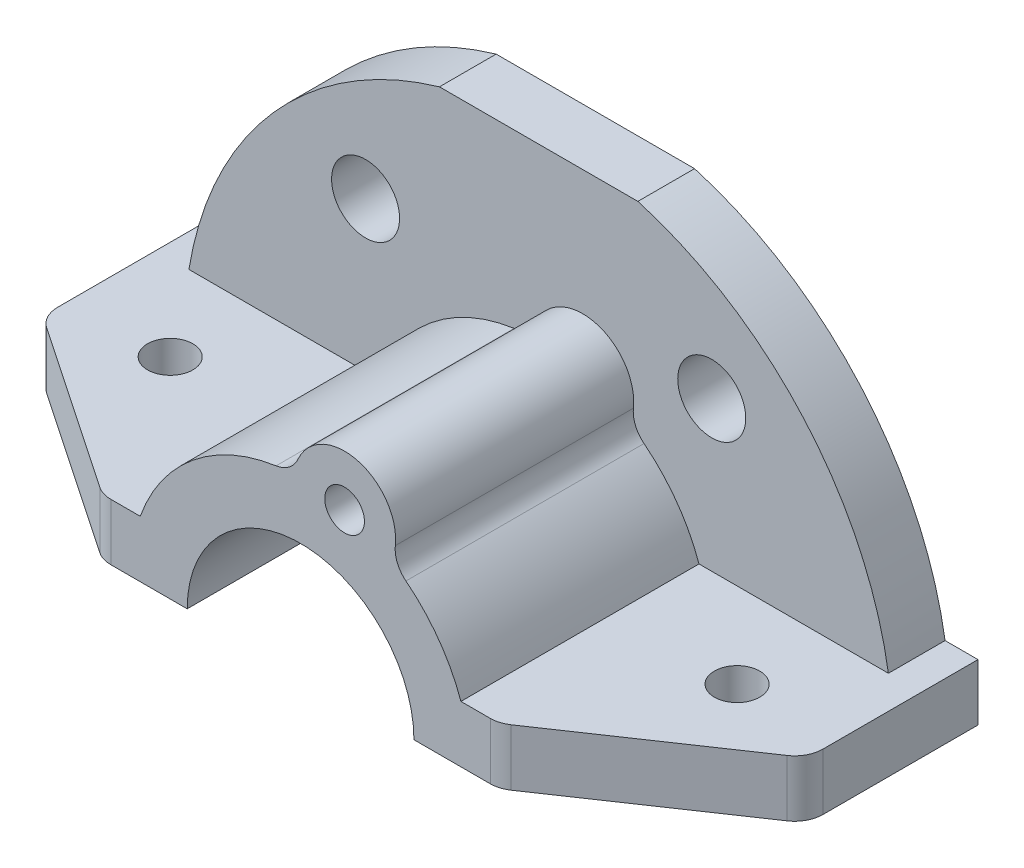
ISO-10303-21;
HEADER;
FILE_DESCRIPTION(('STEP AP214'),'2;1');
FILE_NAME('part.step','',(''),(''),'','','');
FILE_SCHEMA(('AUTOMOTIVE_DESIGN { 1 0 10303 214 1 1 1 1 }'));
ENDSEC;
DATA;
#1=APPLICATION_CONTEXT('core data for automotive mechanical design processes');
#2=APPLICATION_PROTOCOL_DEFINITION('international standard','automotive_design',2000,#1);
#3=PRODUCT_CONTEXT('',#1,'mechanical');
#4=PRODUCT('Part','Part','',(#3));
#5=PRODUCT_RELATED_PRODUCT_CATEGORY('part','',(#4));
#6=PRODUCT_DEFINITION_FORMATION('','',#4);
#7=PRODUCT_DEFINITION_CONTEXT('part definition',#1,'design');
#8=PRODUCT_DEFINITION('design','',#6,#7);
#9=PRODUCT_DEFINITION_SHAPE('','',#8);
#10=(LENGTH_UNIT() NAMED_UNIT(*) SI_UNIT(.MILLI.,.METRE.));
#11=(NAMED_UNIT(*) PLANE_ANGLE_UNIT() SI_UNIT($,.RADIAN.));
#12=(NAMED_UNIT(*) SI_UNIT($,.STERADIAN.) SOLID_ANGLE_UNIT());
#13=UNCERTAINTY_MEASURE_WITH_UNIT(LENGTH_MEASURE(1.E-05),#10,'distance_accuracy_value','');
#14=(GEOMETRIC_REPRESENTATION_CONTEXT(3) GLOBAL_UNCERTAINTY_ASSIGNED_CONTEXT((#13)) GLOBAL_UNIT_ASSIGNED_CONTEXT((#10,
#11,#12)) REPRESENTATION_CONTEXT('',''));
#15=CARTESIAN_POINT('',(0.,0.,0.));
#16=DIRECTION('',(0.,0.,1.));
#17=DIRECTION('',(1.,0.,0.));
#18=AXIS2_PLACEMENT_3D('',#15,#16,#17);
#19=CARTESIAN_POINT('',(7.76457135307574,28.977774788672,-97.0092344550981));
#20=DIRECTION('',(0.,0.,1.));
#21=DIRECTION('',(1.,0.,0.));
#22=AXIS2_PLACEMENT_3D('',#19,#20,#21);
#23=CYLINDRICAL_SURFACE('',#22,9.);
#24=CARTESIAN_POINT('',(7.76457135307574,28.977774788672,-16.));
#25=DIRECTION('',(0.,0.,-1.));
#26=DIRECTION('',(-1.,0.,0.));
#27=AXIS2_PLACEMENT_3D('',#24,#25,#26);
#28=CIRCLE('',#27,9.);
#29=CARTESIAN_POINT('',(16.7125044566661,28.0110829175612,-16.));
#30=VERTEX_POINT('',#29);
#31=CARTESIAN_POINT('',(-0.467911961552641,32.6145616224534,-16.));
#32=VERTEX_POINT('',#31);
#33=EDGE_CURVE('E256',#30,#32,#28,.F.);
#34=ORIENTED_EDGE('',*,*,#33,.T.);
#35=DIRECTION('',(0.,0.,1.));
#36=VECTOR('',#35,1.);
#37=CARTESIAN_POINT('',(-0.467911961552641,32.6145616224534,-97.0092344550981));
#38=LINE('',#37,#36);
#39=CARTESIAN_POINT('',(-0.467911961552641,32.6145616224534,26.));
#40=VERTEX_POINT('',#39);
#41=EDGE_CURVE('E400',#32,#40,#38,.T.);
#42=ORIENTED_EDGE('',*,*,#41,.T.);
#43=CARTESIAN_POINT('',(7.76457135307574,28.977774788672,26.));
#44=DIRECTION('',(0.,0.,1.));
#45=DIRECTION('',(1.,0.,0.));
#46=AXIS2_PLACEMENT_3D('',#43,#44,#45);
#47=CIRCLE('',#46,9.);
#48=CARTESIAN_POINT('',(16.7125044566661,28.0110829175612,26.));
#49=VERTEX_POINT('',#48);
#50=EDGE_CURVE('E318',#49,#40,#47,.T.);
#51=ORIENTED_EDGE('',*,*,#50,.F.);
#52=DIRECTION('',(0.,0.,1.));
#53=VECTOR('',#52,1.);
#54=CARTESIAN_POINT('',(16.7125044566661,28.0110829175612,-97.0092344550981));
#55=LINE('',#54,#53);
#56=EDGE_CURVE('E397',#49,#30,#55,.F.);
#57=ORIENTED_EDGE('',*,*,#56,.T.);
#58=EDGE_LOOP('',(#34,#42,#51,#57));
#59=FACE_BOUND('',#58,.T.);
#60=ADVANCED_FACE('F45',(#59),#23,.T.);
#61=CARTESIAN_POINT('',(0.,0.,-97.0092344550981));
#62=DIRECTION('',(0.,0.,1.));
#63=DIRECTION('',(1.,0.,0.));
#64=AXIS2_PLACEMENT_3D('',#61,#62,#63);
#65=CYLINDRICAL_SURFACE('',#64,30.);
#66=CARTESIAN_POINT('',(0.,0.,26.));
#67=DIRECTION('',(0.,0.,1.));
#68=DIRECTION('',(1.,0.,0.));
#69=AXIS2_PLACEMENT_3D('',#66,#67,#68);
#70=CIRCLE('',#69,30.);
#71=CARTESIAN_POINT('',(-4.32129754543959,29.687141787713,26.));
#72=VERTEX_POINT('',#71);
#73=CARTESIAN_POINT('',(-28.2842712474619,10.,26.));
#74=VERTEX_POINT('',#73);
#75=EDGE_CURVE('E322',#72,#74,#70,.T.);
#76=ORIENTED_EDGE('',*,*,#75,.F.);
#77=DIRECTION('',(0.,0.,1.));
#78=VECTOR('',#77,1.);
#79=CARTESIAN_POINT('',(-4.32129754543959,29.687141787713,-97.0092344550981));
#80=LINE('',#79,#78);
#81=CARTESIAN_POINT('',(-4.32129754543959,29.687141787713,-16.));
#82=VERTEX_POINT('',#81);
#83=EDGE_CURVE('E404',#72,#82,#80,.F.);
#84=ORIENTED_EDGE('',*,*,#83,.T.);
#85=CARTESIAN_POINT('',(0.,0.,-16.));
#86=DIRECTION('',(0.,0.,-1.));
#87=DIRECTION('',(-1.,0.,0.));
#88=AXIS2_PLACEMENT_3D('',#85,#86,#87);
#89=CIRCLE('',#88,30.);
#90=CARTESIAN_POINT('',(-28.2842712474619,10.,-16.));
#91=VERTEX_POINT('',#90);
#92=EDGE_CURVE('E260',#82,#91,#89,.F.);
#93=ORIENTED_EDGE('',*,*,#92,.T.);
#94=DIRECTION('',(0.,0.,1.));
#95=VECTOR('',#94,1.);
#96=CARTESIAN_POINT('',(-28.2842712474619,10.,-97.0092344550981));
#97=LINE('',#96,#95);
#98=EDGE_CURVE('E309',#91,#74,#97,.T.);
#99=ORIENTED_EDGE('',*,*,#98,.T.);
#100=EDGE_LOOP('',(#76,#84,#93,#99));
#101=FACE_BOUND('',#100,.T.);
#102=ADVANCED_FACE('F477',(#101),#65,.T.);
#103=CARTESIAN_POINT('',(0.,0.,-97.0092344550981));
#104=DIRECTION('',(0.,0.,1.));
#105=DIRECTION('',(1.,0.,0.));
#106=AXIS2_PLACEMENT_3D('',#103,#104,#105);
#107=CYLINDRICAL_SURFACE('',#106,30.);
#108=CARTESIAN_POINT('',(0.,0.,-16.));
#109=DIRECTION('',(0.,0.,-1.));
#110=DIRECTION('',(-1.,0.,0.));
#111=AXIS2_PLACEMENT_3D('',#108,#109,#110);
#112=CIRCLE('',#111,30.);
#113=CARTESIAN_POINT('',(28.2842712474619,10.,-16.));
#114=VERTEX_POINT('',#113);
#115=CARTESIAN_POINT('',(18.5859243455187,23.5491701811901,-16.));
#116=VERTEX_POINT('',#115);
#117=EDGE_CURVE('E251',#114,#116,#112,.F.);
#118=ORIENTED_EDGE('',*,*,#117,.T.);
#119=DIRECTION('',(0.,0.,1.));
#120=VECTOR('',#119,1.);
#121=CARTESIAN_POINT('',(18.5859243455187,23.5491701811901,-97.0092344550981));
#122=LINE('',#121,#120);
#123=CARTESIAN_POINT('',(18.5859243455187,23.5491701811901,26.));
#124=VERTEX_POINT('',#123);
#125=EDGE_CURVE('E413',#116,#124,#122,.T.);
#126=ORIENTED_EDGE('',*,*,#125,.T.);
#127=CARTESIAN_POINT('',(0.,0.,26.));
#128=DIRECTION('',(0.,0.,1.));
#129=DIRECTION('',(1.,0.,0.));
#130=AXIS2_PLACEMENT_3D('',#127,#128,#129);
#131=CIRCLE('',#130,30.);
#132=CARTESIAN_POINT('',(28.2842712474619,10.,26.));
#133=VERTEX_POINT('',#132);
#134=EDGE_CURVE('E314',#133,#124,#131,.T.);
#135=ORIENTED_EDGE('',*,*,#134,.F.);
#136=DIRECTION('',(0.,0.,1.));
#137=VECTOR('',#136,1.);
#138=CARTESIAN_POINT('',(28.2842712474619,10.,-97.0092344550981));
#139=LINE('',#138,#137);
#140=EDGE_CURVE('E386',#114,#133,#139,.T.);
#141=ORIENTED_EDGE('',*,*,#140,.F.);
#142=EDGE_LOOP('',(#118,#126,#135,#141));
#143=FACE_BOUND('',#142,.T.);
#144=ADVANCED_FACE('F490',(#143),#107,.T.);
#145=CARTESIAN_POINT('',(0.,10.,-26.));
#146=DIRECTION('',(0.,0.,-1.));
#147=DIRECTION('',(-1.,0.,0.));
#148=AXIS2_PLACEMENT_3D('',#145,#146,#147);
#149=PLANE('',#148);
#150=DIRECTION('',(1.,0.,0.));
#151=VECTOR('',#150,1.);
#152=CARTESIAN_POINT('',(0.,10.,-26.));
#153=LINE('',#152,#151);
#154=CARTESIAN_POINT('',(-67.5,10.,-26.));
#155=VERTEX_POINT('',#154);
#156=CARTESIAN_POINT('',(-61.6948133962653,10.,-26.));
#157=VERTEX_POINT('',#156);
#158=EDGE_CURVE('E372',#155,#157,#153,.T.);
#159=ORIENTED_EDGE('',*,*,#158,.T.);
#160=CARTESIAN_POINT('',(0.,0.,-26.));
#161=DIRECTION('',(0.,0.,-1.));
#162=DIRECTION('',(-1.,0.,0.));
#163=AXIS2_PLACEMENT_3D('',#160,#161,#162);
#164=CIRCLE('',#163,62.5);
#165=CARTESIAN_POINT('',(-17.5,60.,-26.));
#166=VERTEX_POINT('',#165);
#167=EDGE_CURVE('E237',#157,#166,#164,.T.);
#168=ORIENTED_EDGE('',*,*,#167,.T.);
#169=DIRECTION('',(1.,0.,0.));
#170=VECTOR('',#169,1.);
#171=CARTESIAN_POINT('',(0.,60.,-26.));
#172=LINE('',#171,#170);
#173=CARTESIAN_POINT('',(17.5,60.,-26.));
#174=VERTEX_POINT('',#173);
#175=EDGE_CURVE('E216',#166,#174,#172,.T.);
#176=ORIENTED_EDGE('',*,*,#175,.T.);
#177=CARTESIAN_POINT('',(61.6948133962653,10.,-26.));
#178=VERTEX_POINT('',#177);
#179=EDGE_CURVE('E240',#174,#178,#164,.T.);
#180=ORIENTED_EDGE('',*,*,#179,.T.);
#181=DIRECTION('',(1.,0.,0.));
#182=VECTOR('',#181,1.);
#183=CARTESIAN_POINT('',(0.,10.,-26.));
#184=LINE('',#183,#182);
#185=CARTESIAN_POINT('',(67.5,10.,-26.));
#186=VERTEX_POINT('',#185);
#187=EDGE_CURVE('E276',#178,#186,#184,.T.);
#188=ORIENTED_EDGE('',*,*,#187,.T.);
#189=DIRECTION('',(0.,-1.,0.));
#190=VECTOR('',#189,1.);
#191=CARTESIAN_POINT('',(67.5,10.,-26.));
#192=LINE('',#191,#190);
#193=CARTESIAN_POINT('',(67.5,0.,-26.));
#194=VERTEX_POINT('',#193);
#195=EDGE_CURVE('E287',#186,#194,#192,.T.);
#196=ORIENTED_EDGE('',*,*,#195,.T.);
#197=DIRECTION('',(1.,0.,0.));
#198=VECTOR('',#197,1.);
#199=CARTESIAN_POINT('',(0.,0.,-26.));
#200=LINE('',#199,#198);
#201=CARTESIAN_POINT('',(20.,0.,-26.));
#202=VERTEX_POINT('',#201);
#203=EDGE_CURVE('E300',#202,#194,#200,.T.);
#204=ORIENTED_EDGE('',*,*,#203,.F.);
#205=CARTESIAN_POINT('',(0.,0.,-26.));
#206=DIRECTION('',(0.,0.,1.));
#207=DIRECTION('',(1.,0.,0.));
#208=AXIS2_PLACEMENT_3D('',#205,#206,#207);
#209=CIRCLE('',#208,20.);
#210=CARTESIAN_POINT('',(-20.,0.,-26.));
#211=VERTEX_POINT('',#210);
#212=EDGE_CURVE('E335',#202,#211,#209,.T.);
#213=ORIENTED_EDGE('',*,*,#212,.T.);
#214=DIRECTION('',(1.,0.,0.));
#215=VECTOR('',#214,1.);
#216=CARTESIAN_POINT('',(0.,0.,-26.));
#217=LINE('',#216,#215);
#218=CARTESIAN_POINT('',(-67.5,0.,-26.));
#219=VERTEX_POINT('',#218);
#220=EDGE_CURVE('E341',#219,#211,#217,.T.);
#221=ORIENTED_EDGE('',*,*,#220,.F.);
#222=DIRECTION('',(0.,-1.,0.));
#223=VECTOR('',#222,1.);
#224=CARTESIAN_POINT('',(-67.5,10.,-26.));
#225=LINE('',#224,#223);
#226=EDGE_CURVE('E342',#155,#219,#225,.T.);
#227=ORIENTED_EDGE('',*,*,#226,.F.);
#228=EDGE_LOOP('',(#159,#168,#176,#180,#188,#196,#204,#213,#221,#227));
#229=FACE_BOUND('',#228,.T.);
#230=CARTESIAN_POINT('',(7.76457135307574,28.977774788672,-26.));
#231=DIRECTION('',(0.,0.,-1.));
#232=DIRECTION('',(-1.,0.,0.));
#233=AXIS2_PLACEMENT_3D('',#230,#231,#232);
#234=CIRCLE('',#233,3.5);
#235=CARTESIAN_POINT('',(4.26457135307574,28.977774788672,-26.));
#236=VERTEX_POINT('',#235);
#237=EDGE_CURVE('E305',#236,#236,#234,.F.);
#238=ORIENTED_EDGE('',*,*,#237,.T.);
#239=EDGE_LOOP('',(#238));
#240=FACE_BOUND('',#239,.T.);
#241=CARTESIAN_POINT('',(30.5324114601108,36.3871110481513,-26.));
#242=DIRECTION('',(0.,0.,-1.));
#243=DIRECTION('',(-1.,0.,0.));
#244=AXIS2_PLACEMENT_3D('',#241,#242,#243);
#245=CIRCLE('',#244,6.);
#246=CARTESIAN_POINT('',(24.5324114601108,36.3871110481513,-26.));
#247=VERTEX_POINT('',#246);
#248=EDGE_CURVE('E243',#247,#247,#245,.T.);
#249=ORIENTED_EDGE('',*,*,#248,.F.);
#250=EDGE_LOOP('',(#249));
#251=FACE_BOUND('',#250,.T.);
#252=CARTESIAN_POINT('',(-30.5324114601108,36.3871110481513,-26.));
#253=DIRECTION('',(0.,0.,-1.));
#254=DIRECTION('',(-1.,0.,0.));
#255=AXIS2_PLACEMENT_3D('',#252,#253,#254);
#256=CIRCLE('',#255,6.);
#257=CARTESIAN_POINT('',(-36.5324114601108,36.3871110481513,-26.));
#258=VERTEX_POINT('',#257);
#259=EDGE_CURVE('E209',#258,#258,#256,.F.);
#260=ORIENTED_EDGE('',*,*,#259,.T.);
#261=EDGE_LOOP('',(#260));
#262=FACE_BOUND('',#261,.T.);
#263=ADVANCED_FACE('F502',(#229,#240,#251,#262),#149,.T.);
#264=CARTESIAN_POINT('',(0.,10.,26.));
#265=DIRECTION('',(0.,0.,-1.));
#266=DIRECTION('',(-1.,0.,0.));
#267=AXIS2_PLACEMENT_3D('',#264,#265,#266);
#268=PLANE('',#267);
#269=DIRECTION('',(1.,0.,0.));
#270=VECTOR('',#269,1.);
#271=CARTESIAN_POINT('',(0.,10.,26.));
#272=LINE('',#271,#270);
#273=CARTESIAN_POINT('',(-33.4668138849135,10.,26.));
#274=VERTEX_POINT('',#273);
#275=EDGE_CURVE('E352',#274,#74,#272,.T.);
#276=ORIENTED_EDGE('',*,*,#275,.F.);
#277=DIRECTION('',(0.,-1.,0.));
#278=VECTOR('',#277,1.);
#279=CARTESIAN_POINT('',(-33.4668138849135,10.,26.));
#280=LINE('',#279,#278);
#281=CARTESIAN_POINT('',(-33.4668138849135,0.,26.));
#282=VERTEX_POINT('',#281);
#283=EDGE_CURVE('E442',#274,#282,#280,.T.);
#284=ORIENTED_EDGE('',*,*,#283,.T.);
#285=DIRECTION('',(1.,0.,0.));
#286=VECTOR('',#285,1.);
#287=CARTESIAN_POINT('',(0.,0.,26.));
#288=LINE('',#287,#286);
#289=CARTESIAN_POINT('',(-20.,0.,26.));
#290=VERTEX_POINT('',#289);
#291=EDGE_CURVE('E367',#282,#290,#288,.T.);
#292=ORIENTED_EDGE('',*,*,#291,.T.);
#293=CARTESIAN_POINT('',(0.,0.,26.));
#294=DIRECTION('',(0.,0.,1.));
#295=DIRECTION('',(1.,0.,0.));
#296=AXIS2_PLACEMENT_3D('',#293,#294,#295);
#297=CIRCLE('',#296,20.);
#298=CARTESIAN_POINT('',(20.,0.,26.));
#299=VERTEX_POINT('',#298);
#300=EDGE_CURVE('E362',#299,#290,#297,.T.);
#301=ORIENTED_EDGE('',*,*,#300,.F.);
#302=DIRECTION('',(1.,0.,0.));
#303=VECTOR('',#302,1.);
#304=CARTESIAN_POINT('',(0.,0.,26.));
#305=LINE('',#304,#303);
#306=CARTESIAN_POINT('',(33.4668138849134,0.,26.));
#307=VERTEX_POINT('',#306);
#308=EDGE_CURVE('E326',#299,#307,#305,.T.);
#309=ORIENTED_EDGE('',*,*,#308,.T.);
#310=DIRECTION('',(0.,-1.,0.));
#311=VECTOR('',#310,1.);
#312=CARTESIAN_POINT('',(33.4668138849134,10.,26.));
#313=LINE('',#312,#311);
#314=CARTESIAN_POINT('',(33.4668138849134,10.,26.));
#315=VERTEX_POINT('',#314);
#316=EDGE_CURVE('E439',#307,#315,#313,.F.);
#317=ORIENTED_EDGE('',*,*,#316,.T.);
#318=DIRECTION('',(1.,0.,0.));
#319=VECTOR('',#318,1.);
#320=CARTESIAN_POINT('',(0.,10.,26.));
#321=LINE('',#320,#319);
#322=EDGE_CURVE('E280',#133,#315,#321,.T.);
#323=ORIENTED_EDGE('',*,*,#322,.F.);
#324=ORIENTED_EDGE('',*,*,#134,.T.);
#325=CARTESIAN_POINT('',(21.6835784031052,27.4740318780551,26.));
#326=DIRECTION('',(0.,0.,-1.));
#327=DIRECTION('',(-1.,0.,0.));
#328=AXIS2_PLACEMENT_3D('',#325,#326,#327);
#329=CIRCLE('',#328,5.);
#330=EDGE_CURVE('E11',#124,#49,#329,.T.);
#331=ORIENTED_EDGE('',*,*,#330,.T.);
#332=ORIENTED_EDGE('',*,*,#50,.T.);
#333=CARTESIAN_POINT('',(-5.04151380301285,34.6349987523319,26.));
#334=DIRECTION('',(0.,0.,-1.));
#335=DIRECTION('',(-1.,0.,0.));
#336=AXIS2_PLACEMENT_3D('',#333,#334,#335);
#337=CIRCLE('',#336,5.);
#338=EDGE_CURVE('E54',#40,#72,#337,.T.);
#339=ORIENTED_EDGE('',*,*,#338,.T.);
#340=ORIENTED_EDGE('',*,*,#75,.T.);
#341=EDGE_LOOP('',(#276,#284,#292,#301,#309,#317,#323,#324,#331,#332,#339,#340));
#342=FACE_BOUND('',#341,.T.);
#343=CARTESIAN_POINT('',(7.76457135307574,28.977774788672,26.));
#344=DIRECTION('',(0.,0.,1.));
#345=DIRECTION('',(1.,0.,0.));
#346=AXIS2_PLACEMENT_3D('',#343,#344,#345);
#347=CIRCLE('',#346,3.5);
#348=CARTESIAN_POINT('',(11.2645713530757,28.977774788672,26.));
#349=VERTEX_POINT('',#348);
#350=EDGE_CURVE('E304',#349,#349,#347,.T.);
#351=ORIENTED_EDGE('',*,*,#350,.F.);
#352=EDGE_LOOP('',(#351));
#353=FACE_BOUND('',#352,.T.);
#354=ADVANCED_FACE('F470',(#342,#353),#268,.F.);
#355=CARTESIAN_POINT('',(0.,10.,0.));
#356=DIRECTION('',(0.,1.,0.));
#357=DIRECTION('',(0.,0.,1.));
#358=AXIS2_PLACEMENT_3D('',#355,#356,#357);
#359=PLANE('',#358);
#360=DIRECTION('',(0.,0.,-1.));
#361=VECTOR('',#360,1.);
#362=CARTESIAN_POINT('',(-67.5,10.,0.));
#363=LINE('',#362,#361);
#364=CARTESIAN_POINT('',(-67.5,10.,1.34676632209526));
#365=VERTEX_POINT('',#364);
#366=EDGE_CURVE('E347',#365,#155,#363,.T.);
#367=ORIENTED_EDGE('',*,*,#366,.F.);
#368=CARTESIAN_POINT('',(-62.5,10.,1.34676632209526));
#369=DIRECTION('',(0.,1.,0.));
#370=DIRECTION('',(0.,0.,1.));
#371=AXIS2_PLACEMENT_3D('',#368,#369,#370);
#372=CIRCLE('',#371,5.);
#373=CARTESIAN_POINT('',(-65.302832059537,10.,5.48731368277494));
#374=VERTEX_POINT('',#373);
#375=EDGE_CURVE('E436',#365,#374,#372,.T.);
#376=ORIENTED_EDGE('',*,*,#375,.T.);
#377=DIRECTION('',(0.828109472135937,0.,0.560566411907403));
#378=VECTOR('',#377,1.);
#379=CARTESIAN_POINT('',(-23.0676838175621,10.,34.0772601850349));
#380=LINE('',#379,#378);
#381=CARTESIAN_POINT('',(-36.2696459444505,10.,25.1405473606797));
#382=VERTEX_POINT('',#381);
#383=EDGE_CURVE('E363',#374,#382,#380,.T.);
#384=ORIENTED_EDGE('',*,*,#383,.T.);
#385=CARTESIAN_POINT('',(-33.4668138849135,10.,21.));
#386=DIRECTION('',(0.,1.,0.));
#387=DIRECTION('',(0.,0.,1.));
#388=AXIS2_PLACEMENT_3D('',#385,#386,#387);
#389=CIRCLE('',#388,5.);
#390=EDGE_CURVE('E433',#382,#274,#389,.T.);
#391=ORIENTED_EDGE('',*,*,#390,.T.);
#392=ORIENTED_EDGE('',*,*,#275,.T.);
#393=ORIENTED_EDGE('',*,*,#98,.F.);
#394=DIRECTION('',(-1.,0.,0.));
#395=VECTOR('',#394,1.);
#396=CARTESIAN_POINT('',(0.,10.,-16.));
#397=LINE('',#396,#395);
#398=CARTESIAN_POINT('',(-61.6948133962653,10.,-16.));
#399=VERTEX_POINT('',#398);
#400=EDGE_CURVE('E263',#91,#399,#397,.T.);
#401=ORIENTED_EDGE('',*,*,#400,.T.);
#402=DIRECTION('',(0.,0.,-1.));
#403=VECTOR('',#402,1.);
#404=CARTESIAN_POINT('',(-61.6948133962653,10.,-16.));
#405=LINE('',#404,#403);
#406=EDGE_CURVE('E202',#157,#399,#405,.F.);
#407=ORIENTED_EDGE('',*,*,#406,.F.);
#408=ORIENTED_EDGE('',*,*,#158,.F.);
#409=EDGE_LOOP('',(#367,#376,#384,#391,#392,#393,#401,#407,#408));
#410=FACE_BOUND('',#409,.T.);
#411=CARTESIAN_POINT('',(-50.,10.,-0.999999999999997));
#412=DIRECTION('',(0.,1.,0.));
#413=DIRECTION('',(0.,0.,1.));
#414=AXIS2_PLACEMENT_3D('',#411,#412,#413);
#415=CIRCLE('',#414,4.00000000000001);
#416=CARTESIAN_POINT('',(-50.,10.,3.00000000000001));
#417=VERTEX_POINT('',#416);
#418=EDGE_CURVE('E356',#417,#417,#415,.T.);
#419=ORIENTED_EDGE('',*,*,#418,.F.);
#420=EDGE_LOOP('',(#419));
#421=FACE_BOUND('',#420,.T.);
#422=ADVANCED_FACE('F508',(#410,#421),#359,.T.);
#423=CARTESIAN_POINT('',(0.,0.,0.));
#424=DIRECTION('',(0.,1.,0.));
#425=DIRECTION('',(0.,0.,1.));
#426=AXIS2_PLACEMENT_3D('',#423,#424,#425);
#427=PLANE('',#426);
#428=CARTESIAN_POINT('',(-50.,0.,-0.999999999999997));
#429=DIRECTION('',(0.,1.,0.));
#430=DIRECTION('',(0.,0.,1.));
#431=AXIS2_PLACEMENT_3D('',#428,#429,#430);
#432=CIRCLE('',#431,4.00000000000001);
#433=CARTESIAN_POINT('',(-50.,0.,3.00000000000001));
#434=VERTEX_POINT('',#433);
#435=EDGE_CURVE('E348',#434,#434,#432,.T.);
#436=ORIENTED_EDGE('',*,*,#435,.T.);
#437=EDGE_LOOP('',(#436));
#438=FACE_BOUND('',#437,.T.);
#439=DIRECTION('',(0.828109472135937,0.,0.560566411907403));
#440=VECTOR('',#439,1.);
#441=CARTESIAN_POINT('',(-23.0676838175621,0.,34.0772601850349));
#442=LINE('',#441,#440);
#443=CARTESIAN_POINT('',(-65.302832059537,0.,5.48731368277494));
#444=VERTEX_POINT('',#443);
#445=CARTESIAN_POINT('',(-36.2696459444505,0.,25.1405473606797));
#446=VERTEX_POINT('',#445);
#447=EDGE_CURVE('E346',#444,#446,#442,.T.);
#448=ORIENTED_EDGE('',*,*,#447,.F.);
#449=CARTESIAN_POINT('',(-62.5,0.,1.34676632209526));
#450=DIRECTION('',(0.,1.,0.));
#451=DIRECTION('',(0.,0.,1.));
#452=AXIS2_PLACEMENT_3D('',#449,#450,#451);
#453=CIRCLE('',#452,5.);
#454=CARTESIAN_POINT('',(-67.5,0.,1.34676632209526));
#455=VERTEX_POINT('',#454);
#456=EDGE_CURVE('E427',#444,#455,#453,.F.);
#457=ORIENTED_EDGE('',*,*,#456,.T.);
#458=DIRECTION('',(0.,0.,-1.));
#459=VECTOR('',#458,1.);
#460=CARTESIAN_POINT('',(-67.5,0.,0.));
#461=LINE('',#460,#459);
#462=EDGE_CURVE('E340',#455,#219,#461,.T.);
#463=ORIENTED_EDGE('',*,*,#462,.T.);
#464=ORIENTED_EDGE('',*,*,#220,.T.);
#465=DIRECTION('',(0.,0.,1.));
#466=VECTOR('',#465,1.);
#467=CARTESIAN_POINT('',(-20.,0.,-26.));
#468=LINE('',#467,#466);
#469=EDGE_CURVE('E336',#211,#290,#468,.T.);
#470=ORIENTED_EDGE('',*,*,#469,.T.);
#471=ORIENTED_EDGE('',*,*,#291,.F.);
#472=CARTESIAN_POINT('',(-33.4668138849135,0.,21.));
#473=DIRECTION('',(0.,1.,0.));
#474=DIRECTION('',(0.,0.,1.));
#475=AXIS2_PLACEMENT_3D('',#472,#473,#474);
#476=CIRCLE('',#475,5.);
#477=EDGE_CURVE('E424',#282,#446,#476,.F.);
#478=ORIENTED_EDGE('',*,*,#477,.T.);
#479=EDGE_LOOP('',(#448,#457,#463,#464,#470,#471,#478));
#480=FACE_BOUND('',#479,.T.);
#481=ADVANCED_FACE('F518',(#438,#480),#427,.F.);
#482=CARTESIAN_POINT('',(-67.5,10.,0.));
#483=DIRECTION('',(-1.,0.,0.));
#484=DIRECTION('',(0.,0.,1.));
#485=AXIS2_PLACEMENT_3D('',#482,#483,#484);
#486=PLANE('',#485);
#487=ORIENTED_EDGE('',*,*,#462,.F.);
#488=DIRECTION('',(0.,-1.,0.));
#489=VECTOR('',#488,1.);
#490=CARTESIAN_POINT('',(-67.5,10.,1.34676632209526));
#491=LINE('',#490,#489);
#492=EDGE_CURVE('E430',#455,#365,#491,.F.);
#493=ORIENTED_EDGE('',*,*,#492,.T.);
#494=ORIENTED_EDGE('',*,*,#366,.T.);
#495=ORIENTED_EDGE('',*,*,#226,.T.);
#496=EDGE_LOOP('',(#487,#493,#494,#495));
#497=FACE_BOUND('',#496,.T.);
#498=ADVANCED_FACE('F529',(#497),#486,.T.);
#499=CARTESIAN_POINT('',(-23.0676838175621,10.,34.0772601850349));
#500=DIRECTION('',(0.560566411907403,0.,-0.828109472135937));
#501=DIRECTION('',(-0.828109472135937,0.,-0.560566411907403));
#502=AXIS2_PLACEMENT_3D('',#499,#500,#501);
#503=PLANE('',#502);
#504=ORIENTED_EDGE('',*,*,#383,.F.);
#505=DIRECTION('',(0.,-1.,0.));
#506=VECTOR('',#505,1.);
#507=CARTESIAN_POINT('',(-65.302832059537,0.,5.48731368277494));
#508=LINE('',#507,#506);
#509=EDGE_CURVE('E420',#374,#444,#508,.T.);
#510=ORIENTED_EDGE('',*,*,#509,.T.);
#511=ORIENTED_EDGE('',*,*,#447,.T.);
#512=DIRECTION('',(0.,-1.,0.));
#513=VECTOR('',#512,1.);
#514=CARTESIAN_POINT('',(-36.2696459444505,10.,25.1405473606797));
#515=LINE('',#514,#513);
#516=EDGE_CURVE('E417',#446,#382,#515,.F.);
#517=ORIENTED_EDGE('',*,*,#516,.T.);
#518=EDGE_LOOP('',(#504,#510,#511,#517));
#519=FACE_BOUND('',#518,.T.);
#520=ADVANCED_FACE('F521',(#519),#503,.F.);
#521=CARTESIAN_POINT('',(-50.,10.,-0.999999999999997));
#522=DIRECTION('',(0.,-1.,0.));
#523=DIRECTION('',(0.,0.,-1.));
#524=AXIS2_PLACEMENT_3D('',#521,#522,#523);
#525=CYLINDRICAL_SURFACE('',#524,4.00000000000001);
#526=ORIENTED_EDGE('',*,*,#418,.T.);
#527=EDGE_LOOP('',(#526));
#528=FACE_BOUND('',#527,.T.);
#529=ORIENTED_EDGE('',*,*,#435,.F.);
#530=EDGE_LOOP('',(#529));
#531=FACE_BOUND('',#530,.T.);
#532=ADVANCED_FACE('F582',(#528,#531),#525,.F.);
#533=CARTESIAN_POINT('',(0.,0.,-26.));
#534=DIRECTION('',(0.,0.,1.));
#535=DIRECTION('',(1.,0.,0.));
#536=AXIS2_PLACEMENT_3D('',#533,#534,#535);
#537=CYLINDRICAL_SURFACE('',#536,20.);
#538=DIRECTION('',(0.,0.,1.));
#539=VECTOR('',#538,1.);
#540=CARTESIAN_POINT('',(20.,0.,-97.0092344550981));
#541=LINE('',#540,#539);
#542=EDGE_CURVE('E310',#202,#299,#541,.T.);
#543=ORIENTED_EDGE('',*,*,#542,.T.);
#544=ORIENTED_EDGE('',*,*,#300,.T.);
#545=ORIENTED_EDGE('',*,*,#469,.F.);
#546=ORIENTED_EDGE('',*,*,#212,.F.);
#547=EDGE_LOOP('',(#543,#544,#545,#546));
#548=FACE_BOUND('',#547,.T.);
#549=ADVANCED_FACE('F535',(#548),#537,.F.);
#550=CARTESIAN_POINT('',(7.76457135307574,28.977774788672,-97.0092344550981));
#551=DIRECTION('',(0.,0.,1.));
#552=DIRECTION('',(1.,0.,0.));
#553=AXIS2_PLACEMENT_3D('',#550,#551,#552);
#554=CYLINDRICAL_SURFACE('',#553,3.5);
#555=ORIENTED_EDGE('',*,*,#237,.F.);
#556=EDGE_LOOP('',(#555));
#557=FACE_BOUND('',#556,.T.);
#558=ORIENTED_EDGE('',*,*,#350,.T.);
#559=EDGE_LOOP('',(#558));
#560=FACE_BOUND('',#559,.T.);
#561=ADVANCED_FACE('F574',(#557,#560),#554,.F.);
#562=CARTESIAN_POINT('',(0.,0.,-97.0092344550981));
#563=DIRECTION('',(0.,-1.,0.));
#564=DIRECTION('',(0.,0.,-1.));
#565=AXIS2_PLACEMENT_3D('',#562,#563,#564);
#566=PLANE('',#565);
#567=DIRECTION('',(0.,0.,-1.));
#568=VECTOR('',#567,1.);
#569=CARTESIAN_POINT('',(67.5,0.,0.));
#570=LINE('',#569,#568);
#571=CARTESIAN_POINT('',(67.5,0.,1.34676632209523));
#572=VERTEX_POINT('',#571);
#573=EDGE_CURVE('E291',#572,#194,#570,.T.);
#574=ORIENTED_EDGE('',*,*,#573,.F.);
#575=CARTESIAN_POINT('',(62.5,0.,1.34676632209523));
#576=DIRECTION('',(0.,-1.,0.));
#577=DIRECTION('',(0.,0.,-1.));
#578=AXIS2_PLACEMENT_3D('',#575,#576,#577);
#579=CIRCLE('',#578,5.);
#580=CARTESIAN_POINT('',(65.302832059537,0.,5.48731368277491));
#581=VERTEX_POINT('',#580);
#582=EDGE_CURVE('E453',#572,#581,#579,.T.);
#583=ORIENTED_EDGE('',*,*,#582,.T.);
#584=DIRECTION('',(-0.828109472135936,0.,0.560566411907404));
#585=VECTOR('',#584,1.);
#586=CARTESIAN_POINT('',(23.0676838175621,0.,34.0772601850349));
#587=LINE('',#586,#585);
#588=CARTESIAN_POINT('',(36.2696459444505,0.,25.1405473606797));
#589=VERTEX_POINT('',#588);
#590=EDGE_CURVE('E268',#581,#589,#587,.T.);
#591=ORIENTED_EDGE('',*,*,#590,.T.);
#592=CARTESIAN_POINT('',(33.4668138849134,0.,21.));
#593=DIRECTION('',(0.,-1.,0.));
#594=DIRECTION('',(0.,0.,-1.));
#595=AXIS2_PLACEMENT_3D('',#592,#593,#594);
#596=CIRCLE('',#595,5.);
#597=EDGE_CURVE('E450',#589,#307,#596,.T.);
#598=ORIENTED_EDGE('',*,*,#597,.T.);
#599=ORIENTED_EDGE('',*,*,#308,.F.);
#600=ORIENTED_EDGE('',*,*,#542,.F.);
#601=ORIENTED_EDGE('',*,*,#203,.T.);
#602=EDGE_LOOP('',(#574,#583,#591,#598,#599,#600,#601));
#603=FACE_BOUND('',#602,.T.);
#604=CARTESIAN_POINT('',(50.,0.,-1.00000000000001));
#605=DIRECTION('',(0.,1.,0.));
#606=DIRECTION('',(0.,0.,1.));
#607=AXIS2_PLACEMENT_3D('',#604,#605,#606);
#608=CIRCLE('',#607,4.00000000000001);
#609=CARTESIAN_POINT('',(50.,0.,3.));
#610=VERTEX_POINT('',#609);
#611=EDGE_CURVE('E273',#610,#610,#608,.F.);
#612=ORIENTED_EDGE('',*,*,#611,.F.);
#613=EDGE_LOOP('',(#612));
#614=FACE_BOUND('',#613,.T.);
#615=ADVANCED_FACE('F541',(#603,#614),#566,.T.);
#616=CARTESIAN_POINT('',(50.,10.,-1.00000000000001));
#617=DIRECTION('',(0.,-1.,0.));
#618=DIRECTION('',(0.,0.,-1.));
#619=AXIS2_PLACEMENT_3D('',#616,#617,#618);
#620=CYLINDRICAL_SURFACE('',#619,4.00000000000001);
#621=CARTESIAN_POINT('',(50.,10.,-1.00000000000001));
#622=DIRECTION('',(0.,1.,0.));
#623=DIRECTION('',(0.,0.,1.));
#624=AXIS2_PLACEMENT_3D('',#621,#622,#623);
#625=CIRCLE('',#624,4.00000000000001);
#626=CARTESIAN_POINT('',(50.,10.,3.));
#627=VERTEX_POINT('',#626);
#628=EDGE_CURVE('E283',#627,#627,#625,.F.);
#629=ORIENTED_EDGE('',*,*,#628,.F.);
#630=EDGE_LOOP('',(#629));
#631=FACE_BOUND('',#630,.T.);
#632=ORIENTED_EDGE('',*,*,#611,.T.);
#633=EDGE_LOOP('',(#632));
#634=FACE_BOUND('',#633,.T.);
#635=ADVANCED_FACE('F561',(#631,#634),#620,.F.);
#636=CARTESIAN_POINT('',(23.0676838175621,10.,34.0772601850349));
#637=DIRECTION('',(0.560566411907404,0.,0.828109472135936));
#638=DIRECTION('',(0.828109472135937,0.,-0.560566411907404));
#639=AXIS2_PLACEMENT_3D('',#636,#637,#638);
#640=PLANE('',#639);
#641=ORIENTED_EDGE('',*,*,#590,.F.);
#642=DIRECTION('',(0.,-1.,0.));
#643=VECTOR('',#642,1.);
#644=CARTESIAN_POINT('',(65.302832059537,10.,5.48731368277492));
#645=LINE('',#644,#643);
#646=CARTESIAN_POINT('',(65.302832059537,10.,5.48731368277491));
#647=VERTEX_POINT('',#646);
#648=EDGE_CURVE('E68',#581,#647,#645,.F.);
#649=ORIENTED_EDGE('',*,*,#648,.T.);
#650=DIRECTION('',(-0.828109472135936,0.,0.560566411907404));
#651=VECTOR('',#650,1.);
#652=CARTESIAN_POINT('',(23.0676838175621,10.,34.0772601850349));
#653=LINE('',#652,#651);
#654=CARTESIAN_POINT('',(36.2696459444505,10.,25.1405473606797));
#655=VERTEX_POINT('',#654);
#656=EDGE_CURVE('E269',#647,#655,#653,.T.);
#657=ORIENTED_EDGE('',*,*,#656,.T.);
#658=DIRECTION('',(0.,-1.,0.));
#659=VECTOR('',#658,1.);
#660=CARTESIAN_POINT('',(36.2696459444505,0.,25.1405473606797));
#661=LINE('',#660,#659);
#662=EDGE_CURVE('E456',#655,#589,#661,.T.);
#663=ORIENTED_EDGE('',*,*,#662,.T.);
#664=EDGE_LOOP('',(#641,#649,#657,#663));
#665=FACE_BOUND('',#664,.T.);
#666=ADVANCED_FACE('F545',(#665),#640,.T.);
#667=CARTESIAN_POINT('',(67.5,10.,0.));
#668=DIRECTION('',(-1.,0.,0.));
#669=DIRECTION('',(0.,0.,1.));
#670=AXIS2_PLACEMENT_3D('',#667,#668,#669);
#671=PLANE('',#670);
#672=DIRECTION('',(0.,0.,-1.));
#673=VECTOR('',#672,1.);
#674=CARTESIAN_POINT('',(67.5,10.,0.));
#675=LINE('',#674,#673);
#676=CARTESIAN_POINT('',(67.5,10.,1.34676632209523));
#677=VERTEX_POINT('',#676);
#678=EDGE_CURVE('E272',#677,#186,#675,.T.);
#679=ORIENTED_EDGE('',*,*,#678,.F.);
#680=DIRECTION('',(0.,-1.,0.));
#681=VECTOR('',#680,1.);
#682=CARTESIAN_POINT('',(67.5,0.,1.34676632209523));
#683=LINE('',#682,#681);
#684=EDGE_CURVE('E446',#677,#572,#683,.T.);
#685=ORIENTED_EDGE('',*,*,#684,.T.);
#686=ORIENTED_EDGE('',*,*,#573,.T.);
#687=ORIENTED_EDGE('',*,*,#195,.F.);
#688=EDGE_LOOP('',(#679,#685,#686,#687));
#689=FACE_BOUND('',#688,.T.);
#690=ADVANCED_FACE('F552',(#689),#671,.F.);
#691=CARTESIAN_POINT('',(0.,10.,0.));
#692=DIRECTION('',(0.,1.,0.));
#693=DIRECTION('',(0.,0.,1.));
#694=AXIS2_PLACEMENT_3D('',#691,#692,#693);
#695=PLANE('',#694);
#696=ORIENTED_EDGE('',*,*,#656,.F.);
#697=CARTESIAN_POINT('',(62.5,10.,1.34676632209523));
#698=DIRECTION('',(0.,1.,0.));
#699=DIRECTION('',(0.,0.,1.));
#700=AXIS2_PLACEMENT_3D('',#697,#698,#699);
#701=CIRCLE('',#700,5.);
#702=EDGE_CURVE('E464',#647,#677,#701,.T.);
#703=ORIENTED_EDGE('',*,*,#702,.T.);
#704=ORIENTED_EDGE('',*,*,#678,.T.);
#705=ORIENTED_EDGE('',*,*,#187,.F.);
#706=DIRECTION('',(0.,0.,-1.));
#707=VECTOR('',#706,1.);
#708=CARTESIAN_POINT('',(61.6948133962653,10.,-16.));
#709=LINE('',#708,#707);
#710=CARTESIAN_POINT('',(61.6948133962653,10.,-16.));
#711=VERTEX_POINT('',#710);
#712=EDGE_CURVE('E393',#711,#178,#709,.T.);
#713=ORIENTED_EDGE('',*,*,#712,.F.);
#714=DIRECTION('',(-1.,0.,0.));
#715=VECTOR('',#714,1.);
#716=CARTESIAN_POINT('',(0.,10.,-16.));
#717=LINE('',#716,#715);
#718=EDGE_CURVE('E389',#711,#114,#717,.T.);
#719=ORIENTED_EDGE('',*,*,#718,.T.);
#720=ORIENTED_EDGE('',*,*,#140,.T.);
#721=ORIENTED_EDGE('',*,*,#322,.T.);
#722=CARTESIAN_POINT('',(33.4668138849134,10.,21.));
#723=DIRECTION('',(0.,1.,0.));
#724=DIRECTION('',(0.,0.,1.));
#725=AXIS2_PLACEMENT_3D('',#722,#723,#724);
#726=CIRCLE('',#725,5.);
#727=EDGE_CURVE('E61',#315,#655,#726,.T.);
#728=ORIENTED_EDGE('',*,*,#727,.T.);
#729=EDGE_LOOP('',(#696,#703,#704,#705,#713,#719,#720,#721,#728));
#730=FACE_BOUND('',#729,.T.);
#731=ORIENTED_EDGE('',*,*,#628,.T.);
#732=EDGE_LOOP('',(#731));
#733=FACE_BOUND('',#732,.T.);
#734=ADVANCED_FACE('F493',(#730,#733),#695,.T.);
#735=CARTESIAN_POINT('',(0.,0.,-16.));
#736=DIRECTION('',(0.,0.,-1.));
#737=DIRECTION('',(-1.,0.,0.));
#738=AXIS2_PLACEMENT_3D('',#735,#736,#737);
#739=CYLINDRICAL_SURFACE('',#738,62.5);
#740=CARTESIAN_POINT('',(0.,0.,-16.));
#741=DIRECTION('',(0.,0.,-1.));
#742=DIRECTION('',(-1.,0.,0.));
#743=AXIS2_PLACEMENT_3D('',#740,#741,#742);
#744=CIRCLE('',#743,62.5);
#745=CARTESIAN_POINT('',(17.5,60.,-16.));
#746=VERTEX_POINT('',#745);
#747=EDGE_CURVE('E211',#746,#711,#744,.T.);
#748=ORIENTED_EDGE('',*,*,#747,.T.);
#749=ORIENTED_EDGE('',*,*,#712,.T.);
#750=ORIENTED_EDGE('',*,*,#179,.F.);
#751=DIRECTION('',(0.,0.,-1.));
#752=VECTOR('',#751,1.);
#753=CARTESIAN_POINT('',(17.5,60.,-16.));
#754=LINE('',#753,#752);
#755=EDGE_CURVE('E218',#746,#174,#754,.T.);
#756=ORIENTED_EDGE('',*,*,#755,.F.);
#757=EDGE_LOOP('',(#748,#749,#750,#756));
#758=FACE_BOUND('',#757,.T.);
#759=ADVANCED_FACE('F498',(#758),#739,.T.);
#760=CARTESIAN_POINT('',(0.,60.,-16.));
#761=DIRECTION('',(0.,1.,0.));
#762=DIRECTION('',(0.,0.,1.));
#763=AXIS2_PLACEMENT_3D('',#760,#761,#762);
#764=PLANE('',#763);
#765=ORIENTED_EDGE('',*,*,#175,.F.);
#766=DIRECTION('',(0.,0.,-1.));
#767=VECTOR('',#766,1.);
#768=CARTESIAN_POINT('',(-17.5,60.,-16.));
#769=LINE('',#768,#767);
#770=CARTESIAN_POINT('',(-17.5,60.,-16.));
#771=VERTEX_POINT('',#770);
#772=EDGE_CURVE('E199',#771,#166,#769,.T.);
#773=ORIENTED_EDGE('',*,*,#772,.F.);
#774=DIRECTION('',(1.,0.,0.));
#775=VECTOR('',#774,1.);
#776=CARTESIAN_POINT('',(0.,60.,-16.));
#777=LINE('',#776,#775);
#778=EDGE_CURVE('E208',#771,#746,#777,.T.);
#779=ORIENTED_EDGE('',*,*,#778,.T.);
#780=ORIENTED_EDGE('',*,*,#755,.T.);
#781=EDGE_LOOP('',(#765,#773,#779,#780));
#782=FACE_BOUND('',#781,.T.);
#783=ADVANCED_FACE('F214',(#782),#764,.T.);
#784=CARTESIAN_POINT('',(30.5324114601108,36.3871110481513,-16.));
#785=DIRECTION('',(0.,0.,-1.));
#786=DIRECTION('',(-1.,0.,0.));
#787=AXIS2_PLACEMENT_3D('',#784,#785,#786);
#788=CYLINDRICAL_SURFACE('',#787,6.);
#789=CARTESIAN_POINT('',(30.5324114601108,36.3871110481513,-16.));
#790=DIRECTION('',(0.,0.,-1.));
#791=DIRECTION('',(-1.,0.,0.));
#792=AXIS2_PLACEMENT_3D('',#789,#790,#791);
#793=CIRCLE('',#792,6.);
#794=CARTESIAN_POINT('',(24.5324114601108,36.3871110481513,-16.));
#795=VERTEX_POINT('',#794);
#796=EDGE_CURVE('E229',#795,#795,#793,.T.);
#797=ORIENTED_EDGE('',*,*,#796,.F.);
#798=EDGE_LOOP('',(#797));
#799=FACE_BOUND('',#798,.T.);
#800=ORIENTED_EDGE('',*,*,#248,.T.);
#801=EDGE_LOOP('',(#800));
#802=FACE_BOUND('',#801,.T.);
#803=ADVANCED_FACE('F756',(#799,#802),#788,.F.);
#804=ORIENTED_EDGE('',*,*,#167,.F.);
#805=ORIENTED_EDGE('',*,*,#406,.T.);
#806=EDGE_CURVE('E196',#399,#771,#744,.T.);
#807=ORIENTED_EDGE('',*,*,#806,.T.);
#808=ORIENTED_EDGE('',*,*,#772,.T.);
#809=EDGE_LOOP('',(#804,#805,#807,#808));
#810=FACE_BOUND('',#809,.T.);
#811=ADVANCED_FACE('F198',(#810),#739,.T.);
#812=CARTESIAN_POINT('',(-30.5324114601108,36.3871110481513,-16.));
#813=DIRECTION('',(0.,0.,-1.));
#814=DIRECTION('',(-1.,0.,0.));
#815=AXIS2_PLACEMENT_3D('',#812,#813,#814);
#816=CYLINDRICAL_SURFACE('',#815,6.);
#817=CARTESIAN_POINT('',(-30.5324114601108,36.3871110481513,-16.));
#818=DIRECTION('',(0.,0.,-1.));
#819=DIRECTION('',(-1.,0.,0.));
#820=AXIS2_PLACEMENT_3D('',#817,#818,#819);
#821=CIRCLE('',#820,6.);
#822=CARTESIAN_POINT('',(-36.5324114601108,36.3871110481513,-16.));
#823=VERTEX_POINT('',#822);
#824=EDGE_CURVE('E219',#823,#823,#821,.F.);
#825=ORIENTED_EDGE('',*,*,#824,.T.);
#826=EDGE_LOOP('',(#825));
#827=FACE_BOUND('',#826,.T.);
#828=ORIENTED_EDGE('',*,*,#259,.F.);
#829=EDGE_LOOP('',(#828));
#830=FACE_BOUND('',#829,.T.);
#831=ADVANCED_FACE('F653',(#827,#830),#816,.F.);
#832=CARTESIAN_POINT('',(0.,0.,-16.));
#833=DIRECTION('',(0.,0.,-1.));
#834=DIRECTION('',(-1.,0.,0.));
#835=AXIS2_PLACEMENT_3D('',#832,#833,#834);
#836=PLANE('',#835);
#837=ORIENTED_EDGE('',*,*,#92,.F.);
#838=CARTESIAN_POINT('',(-5.04151380301285,34.6349987523319,-16.));
#839=DIRECTION('',(0.,0.,-1.));
#840=DIRECTION('',(-1.,0.,0.));
#841=AXIS2_PLACEMENT_3D('',#838,#839,#840);
#842=CIRCLE('',#841,5.);
#843=EDGE_CURVE('E410',#82,#32,#842,.F.);
#844=ORIENTED_EDGE('',*,*,#843,.T.);
#845=ORIENTED_EDGE('',*,*,#33,.F.);
#846=CARTESIAN_POINT('',(21.6835784031052,27.4740318780551,-16.));
#847=DIRECTION('',(0.,0.,-1.));
#848=DIRECTION('',(-1.,0.,0.));
#849=AXIS2_PLACEMENT_3D('',#846,#847,#848);
#850=CIRCLE('',#849,5.);
#851=EDGE_CURVE('E407',#30,#116,#850,.F.);
#852=ORIENTED_EDGE('',*,*,#851,.T.);
#853=ORIENTED_EDGE('',*,*,#117,.F.);
#854=ORIENTED_EDGE('',*,*,#718,.F.);
#855=ORIENTED_EDGE('',*,*,#747,.F.);
#856=ORIENTED_EDGE('',*,*,#778,.F.);
#857=ORIENTED_EDGE('',*,*,#806,.F.);
#858=ORIENTED_EDGE('',*,*,#400,.F.);
#859=EDGE_LOOP('',(#837,#844,#845,#852,#853,#854,#855,#856,#857,#858));
#860=FACE_BOUND('',#859,.T.);
#861=ORIENTED_EDGE('',*,*,#796,.T.);
#862=EDGE_LOOP('',(#861));
#863=FACE_BOUND('',#862,.T.);
#864=ORIENTED_EDGE('',*,*,#824,.F.);
#865=EDGE_LOOP('',(#864));
#866=FACE_BOUND('',#865,.T.);
#867=ADVANCED_FACE('F223',(#860,#863,#866),#836,.F.);
#868=CARTESIAN_POINT('',(-5.04151380301285,34.6349987523319,-97.0092344550981));
#869=DIRECTION('',(0.,0.,-1.));
#870=DIRECTION('',(-1.,0.,0.));
#871=AXIS2_PLACEMENT_3D('',#868,#869,#870);
#872=CYLINDRICAL_SURFACE('',#871,5.);
#873=ORIENTED_EDGE('',*,*,#843,.F.);
#874=ORIENTED_EDGE('',*,*,#83,.F.);
#875=ORIENTED_EDGE('',*,*,#338,.F.);
#876=ORIENTED_EDGE('',*,*,#41,.F.);
#877=EDGE_LOOP('',(#873,#874,#875,#876));
#878=FACE_BOUND('',#877,.T.);
#879=ADVANCED_FACE('F480',(#878),#872,.F.);
#880=CARTESIAN_POINT('',(21.6835784031052,27.4740318780551,-97.0092344550981));
#881=DIRECTION('',(0.,0.,-1.));
#882=DIRECTION('',(-1.,0.,0.));
#883=AXIS2_PLACEMENT_3D('',#880,#881,#882);
#884=CYLINDRICAL_SURFACE('',#883,5.);
#885=ORIENTED_EDGE('',*,*,#851,.F.);
#886=ORIENTED_EDGE('',*,*,#56,.F.);
#887=ORIENTED_EDGE('',*,*,#330,.F.);
#888=ORIENTED_EDGE('',*,*,#125,.F.);
#889=EDGE_LOOP('',(#885,#886,#887,#888));
#890=FACE_BOUND('',#889,.T.);
#891=ADVANCED_FACE('F486',(#890),#884,.F.);
#892=CARTESIAN_POINT('',(-62.5,10.,1.34676632209526));
#893=DIRECTION('',(0.,1.,0.));
#894=DIRECTION('',(0.,0.,1.));
#895=AXIS2_PLACEMENT_3D('',#892,#893,#894);
#896=CYLINDRICAL_SURFACE('',#895,5.);
#897=ORIENTED_EDGE('',*,*,#375,.F.);
#898=ORIENTED_EDGE('',*,*,#492,.F.);
#899=ORIENTED_EDGE('',*,*,#456,.F.);
#900=ORIENTED_EDGE('',*,*,#509,.F.);
#901=EDGE_LOOP('',(#897,#898,#899,#900));
#902=FACE_BOUND('',#901,.T.);
#903=ADVANCED_FACE('F525',(#902),#896,.T.);
#904=CARTESIAN_POINT('',(-33.4668138849135,10.,21.));
#905=DIRECTION('',(0.,-1.,0.));
#906=DIRECTION('',(0.,0.,-1.));
#907=AXIS2_PLACEMENT_3D('',#904,#905,#906);
#908=CYLINDRICAL_SURFACE('',#907,5.);
#909=ORIENTED_EDGE('',*,*,#390,.F.);
#910=ORIENTED_EDGE('',*,*,#516,.F.);
#911=ORIENTED_EDGE('',*,*,#477,.F.);
#912=ORIENTED_EDGE('',*,*,#283,.F.);
#913=EDGE_LOOP('',(#909,#910,#911,#912));
#914=FACE_BOUND('',#913,.T.);
#915=ADVANCED_FACE('F514',(#914),#908,.T.);
#916=CARTESIAN_POINT('',(62.5,10.,1.34676632209523));
#917=DIRECTION('',(0.,1.,0.));
#918=DIRECTION('',(0.,0.,1.));
#919=AXIS2_PLACEMENT_3D('',#916,#917,#918);
#920=CYLINDRICAL_SURFACE('',#919,5.);
#921=ORIENTED_EDGE('',*,*,#702,.F.);
#922=ORIENTED_EDGE('',*,*,#648,.F.);
#923=ORIENTED_EDGE('',*,*,#582,.F.);
#924=ORIENTED_EDGE('',*,*,#684,.F.);
#925=EDGE_LOOP('',(#921,#922,#923,#924));
#926=FACE_BOUND('',#925,.T.);
#927=ADVANCED_FACE('F550',(#926),#920,.T.);
#928=CARTESIAN_POINT('',(33.4668138849134,10.,21.));
#929=DIRECTION('',(0.,1.,0.));
#930=DIRECTION('',(0.,0.,1.));
#931=AXIS2_PLACEMENT_3D('',#928,#929,#930);
#932=CYLINDRICAL_SURFACE('',#931,5.);
#933=ORIENTED_EDGE('',*,*,#727,.F.);
#934=ORIENTED_EDGE('',*,*,#316,.F.);
#935=ORIENTED_EDGE('',*,*,#597,.F.);
#936=ORIENTED_EDGE('',*,*,#662,.F.);
#937=EDGE_LOOP('',(#933,#934,#935,#936));
#938=FACE_BOUND('',#937,.T.);
#939=ADVANCED_FACE('F47',(#938),#932,.T.);
#940=CLOSED_SHELL('',(#60,#102,#144,#263,#354,#422,#481,#498,#520,#532,#549,#561,#615,#635,#666,
#690,#734,#759,#783,#803,#811,#831,#867,#879,#891,#903,#915,#927,#939));
#941=MANIFOLD_SOLID_BREP('B2',#940);
#942=ADVANCED_BREP_SHAPE_REPRESENTATION('',(#18,#941),#14);
#943=SHAPE_DEFINITION_REPRESENTATION(#9,#942);
ENDSEC;
END-ISO-10303-21;
